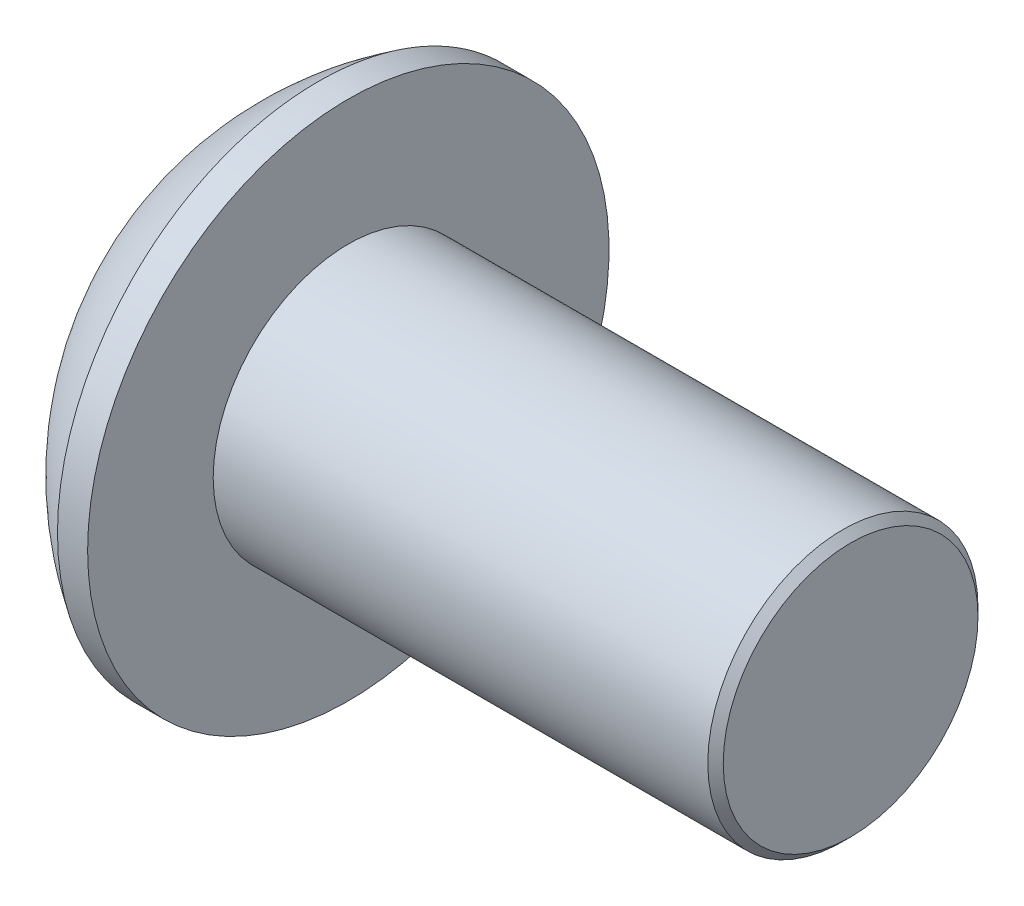
ISO-10303-21;
HEADER;
FILE_DESCRIPTION(('STEP AP214'),'2;1');
FILE_NAME('part.step','',(''),(''),'','','');
FILE_SCHEMA(('AUTOMOTIVE_DESIGN { 1 0 10303 214 1 1 1 1 }'));
ENDSEC;
DATA;
#1=APPLICATION_CONTEXT('core data for automotive mechanical design processes');
#2=APPLICATION_PROTOCOL_DEFINITION('international standard','automotive_design',2000,#1);
#3=PRODUCT_CONTEXT('',#1,'mechanical');
#4=PRODUCT('Part','Part','',(#3));
#5=PRODUCT_RELATED_PRODUCT_CATEGORY('part','',(#4));
#6=PRODUCT_DEFINITION_FORMATION('','',#4);
#7=PRODUCT_DEFINITION_CONTEXT('part definition',#1,'design');
#8=PRODUCT_DEFINITION('design','',#6,#7);
#9=PRODUCT_DEFINITION_SHAPE('','',#8);
#10=(LENGTH_UNIT() NAMED_UNIT(*) SI_UNIT(.MILLI.,.METRE.));
#11=(NAMED_UNIT(*) PLANE_ANGLE_UNIT() SI_UNIT($,.RADIAN.));
#12=(NAMED_UNIT(*) SI_UNIT($,.STERADIAN.) SOLID_ANGLE_UNIT());
#13=UNCERTAINTY_MEASURE_WITH_UNIT(LENGTH_MEASURE(1.E-05),#10,'distance_accuracy_value','');
#14=(GEOMETRIC_REPRESENTATION_CONTEXT(3) GLOBAL_UNCERTAINTY_ASSIGNED_CONTEXT((#13)) GLOBAL_UNIT_ASSIGNED_CONTEXT((#10,
#11,#12)) REPRESENTATION_CONTEXT('',''));
#15=CARTESIAN_POINT('',(0.,0.,0.));
#16=DIRECTION('',(0.,0.,1.));
#17=DIRECTION('',(1.,0.,0.));
#18=AXIS2_PLACEMENT_3D('',#15,#16,#17);
#19=CARTESIAN_POINT('',(1.32080000000034,0.,0.));
#20=DIRECTION('',(-1.,0.,0.));
#21=DIRECTION('',(0.,0.,1.));
#22=AXIS2_PLACEMENT_3D('',#19,#20,#21);
#23=CONICAL_SURFACE('',#22,1.1937999999998,1.04719755119608);
#24=CARTESIAN_POINT('',(2.01004075135902,0.,4.44089209850063E-13));
#25=VERTEX_POINT('',#24);
#26=VERTEX_LOOP('',#25);
#27=FACE_BOUND('',#26,.T.);
#28=CARTESIAN_POINT('',(1.32080000000009,0.,0.));
#29=DIRECTION('',(-1.,0.,0.));
#30=DIRECTION('',(0.,0.,1.));
#31=AXIS2_PLACEMENT_3D('',#28,#29,#30);
#32=CIRCLE('',#31,1.19380000000024);
#33=CARTESIAN_POINT('',(1.32080000000004,-1.03386112703797,0.59690000000006));
#34=VERTEX_POINT('',#33);
#35=CARTESIAN_POINT('',(1.32080000000004,0.,1.19380000000012));
#36=VERTEX_POINT('',#35);
#37=EDGE_CURVE('E19',#34,#36,#32,.T.);
#38=ORIENTED_EDGE('',*,*,#37,.T.);
#39=CARTESIAN_POINT('',(1.32080000000009,0.,0.));
#40=DIRECTION('',(-1.,0.,0.));
#41=DIRECTION('',(0.,0.,1.));
#42=AXIS2_PLACEMENT_3D('',#39,#40,#41);
#43=CIRCLE('',#42,1.19380000000024);
#44=CARTESIAN_POINT('',(1.32080000000004,1.03386112703797,0.596900000000061));
#45=VERTEX_POINT('',#44);
#46=EDGE_CURVE('E148',#36,#45,#43,.T.);
#47=ORIENTED_EDGE('',*,*,#46,.T.);
#48=CARTESIAN_POINT('',(1.32080000000009,0.,0.));
#49=DIRECTION('',(-1.,0.,0.));
#50=DIRECTION('',(0.,0.,1.));
#51=AXIS2_PLACEMENT_3D('',#48,#49,#50);
#52=CIRCLE('',#51,1.19380000000024);
#53=CARTESIAN_POINT('',(1.32080000000004,1.03386112703797,-0.596900000000061));
#54=VERTEX_POINT('',#53);
#55=EDGE_CURVE('E476',#45,#54,#52,.T.);
#56=ORIENTED_EDGE('',*,*,#55,.T.);
#57=CARTESIAN_POINT('',(1.32080000000009,0.,0.));
#58=DIRECTION('',(-1.,0.,0.));
#59=DIRECTION('',(0.,0.,1.));
#60=AXIS2_PLACEMENT_3D('',#57,#58,#59);
#61=CIRCLE('',#60,1.19380000000024);
#62=CARTESIAN_POINT('',(1.32080000000004,1.49457637585666E-12,-1.19380000000012));
#63=VERTEX_POINT('',#62);
#64=EDGE_CURVE('E477',#54,#63,#61,.T.);
#65=ORIENTED_EDGE('',*,*,#64,.T.);
#66=CARTESIAN_POINT('',(1.32080000000009,0.,0.));
#67=DIRECTION('',(-1.,0.,0.));
#68=DIRECTION('',(0.,0.,1.));
#69=AXIS2_PLACEMENT_3D('',#66,#67,#68);
#70=CIRCLE('',#69,1.19380000000024);
#71=CARTESIAN_POINT('',(1.32080000000004,-1.03386112703797,-0.59690000000006));
#72=VERTEX_POINT('',#71);
#73=EDGE_CURVE('E92',#63,#72,#70,.T.);
#74=ORIENTED_EDGE('',*,*,#73,.T.);
#75=CARTESIAN_POINT('',(1.32080000000009,0.,0.));
#76=DIRECTION('',(-1.,0.,0.));
#77=DIRECTION('',(0.,0.,1.));
#78=AXIS2_PLACEMENT_3D('',#75,#76,#77);
#79=CIRCLE('',#78,1.19380000000024);
#80=EDGE_CURVE('E88',#72,#34,#79,.T.);
#81=ORIENTED_EDGE('',*,*,#80,.T.);
#82=EDGE_LOOP('',(#38,#47,#56,#65,#74,#81));
#83=FACE_BOUND('',#82,.T.);
#84=ADVANCED_FACE('F16',(#27,#83),#23,.F.);
#85=CARTESIAN_POINT('',(1.3208,-2.06772225407572,-1.1938));
#86=DIRECTION('',(1.,0.,0.));
#87=DIRECTION('',(0.,0.,-1.));
#88=AXIS2_PLACEMENT_3D('',#85,#86,#87);
#89=PLANE('',#88);
#90=DIRECTION('',(0.,0.5,0.866025403784439));
#91=VECTOR('',#90,1.);
#92=CARTESIAN_POINT('',(1.3208,-1.37848150271715,0.));
#93=LINE('',#92,#91);
#94=CARTESIAN_POINT('',(1.3208,-0.689240751358574,1.1938));
#95=VERTEX_POINT('',#94);
#96=EDGE_CURVE('E100',#95,#34,#93,.F.);
#97=ORIENTED_EDGE('',*,*,#96,.F.);
#98=DIRECTION('',(0.,1.,0.));
#99=VECTOR('',#98,1.);
#100=CARTESIAN_POINT('',(1.3208,-0.689240751358574,1.1938));
#101=LINE('',#100,#99);
#102=EDGE_CURVE('E102',#36,#95,#101,.F.);
#103=ORIENTED_EDGE('',*,*,#102,.F.);
#104=ORIENTED_EDGE('',*,*,#37,.F.);
#105=EDGE_LOOP('',(#97,#103,#104));
#106=FACE_BOUND('',#105,.T.);
#107=ADVANCED_FACE('F98',(#106),#89,.F.);
#108=CARTESIAN_POINT('',(1.3208,-2.06772225407572,-1.1938));
#109=DIRECTION('',(1.,0.,0.));
#110=DIRECTION('',(0.,0.,-1.));
#111=AXIS2_PLACEMENT_3D('',#108,#109,#110);
#112=PLANE('',#111);
#113=DIRECTION('',(0.,-0.5,0.866025403784439));
#114=VECTOR('',#113,1.);
#115=CARTESIAN_POINT('',(1.3208,-0.689240751358574,-1.1938));
#116=LINE('',#115,#114);
#117=CARTESIAN_POINT('',(1.3208,-1.37848150271715,0.));
#118=VERTEX_POINT('',#117);
#119=EDGE_CURVE('E108',#118,#72,#116,.F.);
#120=ORIENTED_EDGE('',*,*,#119,.F.);
#121=DIRECTION('',(0.,0.5,0.866025403784439));
#122=VECTOR('',#121,1.);
#123=CARTESIAN_POINT('',(1.3208,-1.37848150271715,0.));
#124=LINE('',#123,#122);
#125=EDGE_CURVE('E105',#34,#118,#124,.F.);
#126=ORIENTED_EDGE('',*,*,#125,.F.);
#127=ORIENTED_EDGE('',*,*,#80,.F.);
#128=EDGE_LOOP('',(#120,#126,#127));
#129=FACE_BOUND('',#128,.T.);
#130=ADVANCED_FACE('F106',(#129),#112,.F.);
#131=CARTESIAN_POINT('',(1.3208,-2.06772225407572,-1.1938));
#132=DIRECTION('',(1.,0.,0.));
#133=DIRECTION('',(0.,0.,-1.));
#134=AXIS2_PLACEMENT_3D('',#131,#132,#133);
#135=PLANE('',#134);
#136=DIRECTION('',(0.,1.,0.));
#137=VECTOR('',#136,1.);
#138=CARTESIAN_POINT('',(1.3208,0.689240751358577,-1.1938));
#139=LINE('',#138,#137);
#140=CARTESIAN_POINT('',(1.3208,-0.689240751358574,-1.1938));
#141=VERTEX_POINT('',#140);
#142=EDGE_CURVE('E447',#141,#63,#139,.T.);
#143=ORIENTED_EDGE('',*,*,#142,.F.);
#144=DIRECTION('',(0.,-0.5,0.866025403784439));
#145=VECTOR('',#144,1.);
#146=CARTESIAN_POINT('',(1.3208,-0.689240751358574,-1.1938));
#147=LINE('',#146,#145);
#148=EDGE_CURVE('E459',#72,#141,#147,.F.);
#149=ORIENTED_EDGE('',*,*,#148,.F.);
#150=ORIENTED_EDGE('',*,*,#73,.F.);
#151=EDGE_LOOP('',(#143,#149,#150));
#152=FACE_BOUND('',#151,.T.);
#153=ADVANCED_FACE('F191',(#152),#135,.F.);
#154=CARTESIAN_POINT('',(1.3208,-2.06772225407572,-1.1938));
#155=DIRECTION('',(1.,0.,0.));
#156=DIRECTION('',(0.,0.,-1.));
#157=AXIS2_PLACEMENT_3D('',#154,#155,#156);
#158=PLANE('',#157);
#159=DIRECTION('',(0.,-0.5,-0.866025403784439));
#160=VECTOR('',#159,1.);
#161=CARTESIAN_POINT('',(1.3208,1.37848150271715,0.));
#162=LINE('',#161,#160);
#163=CARTESIAN_POINT('',(1.3208,0.689240751358577,-1.1938));
#164=VERTEX_POINT('',#163);
#165=EDGE_CURVE('E433',#164,#54,#162,.F.);
#166=ORIENTED_EDGE('',*,*,#165,.F.);
#167=DIRECTION('',(0.,1.,0.));
#168=VECTOR('',#167,1.);
#169=CARTESIAN_POINT('',(1.3208,0.689240751358577,-1.1938));
#170=LINE('',#169,#168);
#171=EDGE_CURVE('E444',#63,#164,#170,.T.);
#172=ORIENTED_EDGE('',*,*,#171,.F.);
#173=ORIENTED_EDGE('',*,*,#64,.F.);
#174=EDGE_LOOP('',(#166,#172,#173));
#175=FACE_BOUND('',#174,.T.);
#176=ADVANCED_FACE('F187',(#175),#158,.F.);
#177=CARTESIAN_POINT('',(1.3208,-2.06772225407572,-1.1938));
#178=DIRECTION('',(1.,0.,0.));
#179=DIRECTION('',(0.,0.,-1.));
#180=AXIS2_PLACEMENT_3D('',#177,#178,#179);
#181=PLANE('',#180);
#182=DIRECTION('',(0.,0.5,-0.866025403784439));
#183=VECTOR('',#182,1.);
#184=CARTESIAN_POINT('',(1.3208,0.689240751358576,1.1938));
#185=LINE('',#184,#183);
#186=CARTESIAN_POINT('',(1.3208,1.37848150271715,0.));
#187=VERTEX_POINT('',#186);
#188=EDGE_CURVE('E412',#187,#45,#185,.F.);
#189=ORIENTED_EDGE('',*,*,#188,.F.);
#190=DIRECTION('',(0.,-0.5,-0.866025403784439));
#191=VECTOR('',#190,1.);
#192=CARTESIAN_POINT('',(1.3208,1.37848150271715,0.));
#193=LINE('',#192,#191);
#194=EDGE_CURVE('E431',#54,#187,#193,.F.);
#195=ORIENTED_EDGE('',*,*,#194,.F.);
#196=ORIENTED_EDGE('',*,*,#55,.F.);
#197=EDGE_LOOP('',(#189,#195,#196));
#198=FACE_BOUND('',#197,.T.);
#199=ADVANCED_FACE('F183',(#198),#181,.F.);
#200=CARTESIAN_POINT('',(1.3208,-2.06772225407572,-1.1938));
#201=DIRECTION('',(1.,0.,0.));
#202=DIRECTION('',(0.,0.,-1.));
#203=AXIS2_PLACEMENT_3D('',#200,#201,#202);
#204=PLANE('',#203);
#205=DIRECTION('',(0.,1.,0.));
#206=VECTOR('',#205,1.);
#207=CARTESIAN_POINT('',(1.3208,-0.689240751358574,1.1938));
#208=LINE('',#207,#206);
#209=CARTESIAN_POINT('',(1.3208,0.689240751358576,1.1938));
#210=VERTEX_POINT('',#209);
#211=EDGE_CURVE('E117',#210,#36,#208,.F.);
#212=ORIENTED_EDGE('',*,*,#211,.F.);
#213=DIRECTION('',(0.,0.5,-0.866025403784439));
#214=VECTOR('',#213,1.);
#215=CARTESIAN_POINT('',(1.3208,0.689240751358576,1.1938));
#216=LINE('',#215,#214);
#217=EDGE_CURVE('E415',#45,#210,#216,.F.);
#218=ORIENTED_EDGE('',*,*,#217,.F.);
#219=ORIENTED_EDGE('',*,*,#46,.F.);
#220=EDGE_LOOP('',(#212,#218,#219));
#221=FACE_BOUND('',#220,.T.);
#222=ADVANCED_FACE('F179',(#221),#204,.F.);
#223=CARTESIAN_POINT('',(1.3208,-0.689240751358574,1.1938));
#224=DIRECTION('',(0.,0.,-1.));
#225=DIRECTION('',(0.,1.,0.));
#226=AXIS2_PLACEMENT_3D('',#223,#224,#225);
#227=PLANE('',#226);
#228=DIRECTION('',(0.,1.,0.));
#229=VECTOR('',#228,1.);
#230=CARTESIAN_POINT('',(0.,0.,1.1938));
#231=LINE('',#230,#229);
#232=CARTESIAN_POINT('',(0.,0.689240751358577,1.1938));
#233=VERTEX_POINT('',#232);
#234=CARTESIAN_POINT('',(0.,-0.689240751358574,1.1938));
#235=VERTEX_POINT('',#234);
#236=EDGE_CURVE('E409',#233,#235,#231,.F.);
#237=ORIENTED_EDGE('',*,*,#236,.F.);
#238=DIRECTION('',(1.,0.,0.));
#239=VECTOR('',#238,1.);
#240=CARTESIAN_POINT('',(1.3208,0.689240751358576,1.1938));
#241=LINE('',#240,#239);
#242=EDGE_CURVE('E421',#210,#233,#241,.F.);
#243=ORIENTED_EDGE('',*,*,#242,.F.);
#244=ORIENTED_EDGE('',*,*,#211,.T.);
#245=ORIENTED_EDGE('',*,*,#102,.T.);
#246=DIRECTION('',(1.,0.,0.));
#247=VECTOR('',#246,1.);
#248=CARTESIAN_POINT('',(1.3208,-0.689240751358574,1.1938));
#249=LINE('',#248,#247);
#250=EDGE_CURVE('E111',#235,#95,#249,.T.);
#251=ORIENTED_EDGE('',*,*,#250,.F.);
#252=EDGE_LOOP('',(#237,#243,#244,#245,#251));
#253=FACE_BOUND('',#252,.T.);
#254=ADVANCED_FACE('F176',(#253),#227,.T.);
#255=CARTESIAN_POINT('',(1.3208,-1.37848150271715,0.));
#256=DIRECTION('',(0.,0.866025403784439,-0.5));
#257=DIRECTION('',(0.,0.5,0.866025403784439));
#258=AXIS2_PLACEMENT_3D('',#255,#256,#257);
#259=PLANE('',#258);
#260=DIRECTION('',(0.,-0.5,-0.866025403784439));
#261=VECTOR('',#260,1.);
#262=CARTESIAN_POINT('',(0.,-0.689240751358574,1.1938));
#263=LINE('',#262,#261);
#264=CARTESIAN_POINT('',(0.,-1.37848150271715,0.));
#265=VERTEX_POINT('',#264);
#266=EDGE_CURVE('E406',#235,#265,#263,.T.);
#267=ORIENTED_EDGE('',*,*,#266,.F.);
#268=ORIENTED_EDGE('',*,*,#250,.T.);
#269=ORIENTED_EDGE('',*,*,#96,.T.);
#270=ORIENTED_EDGE('',*,*,#125,.T.);
#271=DIRECTION('',(1.,0.,0.));
#272=VECTOR('',#271,1.);
#273=CARTESIAN_POINT('',(1.3208,-1.37848150271715,0.));
#274=LINE('',#273,#272);
#275=EDGE_CURVE('E456',#265,#118,#274,.T.);
#276=ORIENTED_EDGE('',*,*,#275,.F.);
#277=EDGE_LOOP('',(#267,#268,#269,#270,#276));
#278=FACE_BOUND('',#277,.T.);
#279=ADVANCED_FACE('F115',(#278),#259,.T.);
#280=CARTESIAN_POINT('',(1.3208,-0.689240751358574,-1.1938));
#281=DIRECTION('',(0.,0.866025403784439,0.5));
#282=DIRECTION('',(0.,-0.5,0.866025403784439));
#283=AXIS2_PLACEMENT_3D('',#280,#281,#282);
#284=PLANE('',#283);
#285=DIRECTION('',(0.,0.5,-0.866025403784439));
#286=VECTOR('',#285,1.);
#287=CARTESIAN_POINT('',(0.,-1.37848150271715,0.));
#288=LINE('',#287,#286);
#289=CARTESIAN_POINT('',(0.,-0.689240751358574,-1.1938));
#290=VERTEX_POINT('',#289);
#291=EDGE_CURVE('E403',#265,#290,#288,.T.);
#292=ORIENTED_EDGE('',*,*,#291,.F.);
#293=ORIENTED_EDGE('',*,*,#275,.T.);
#294=ORIENTED_EDGE('',*,*,#119,.T.);
#295=ORIENTED_EDGE('',*,*,#148,.T.);
#296=DIRECTION('',(1.,0.,0.));
#297=VECTOR('',#296,1.);
#298=CARTESIAN_POINT('',(1.3208,-0.689240751358574,-1.1938));
#299=LINE('',#298,#297);
#300=EDGE_CURVE('E441',#290,#141,#299,.T.);
#301=ORIENTED_EDGE('',*,*,#300,.F.);
#302=EDGE_LOOP('',(#292,#293,#294,#295,#301));
#303=FACE_BOUND('',#302,.T.);
#304=ADVANCED_FACE('F169',(#303),#284,.T.);
#305=CARTESIAN_POINT('',(1.3208,0.689240751358577,-1.1938));
#306=DIRECTION('',(0.,0.,1.));
#307=DIRECTION('',(1.,0.,0.));
#308=AXIS2_PLACEMENT_3D('',#305,#306,#307);
#309=PLANE('',#308);
#310=DIRECTION('',(0.,1.,0.));
#311=VECTOR('',#310,1.);
#312=CARTESIAN_POINT('',(0.,0.,-1.1938));
#313=LINE('',#312,#311);
#314=CARTESIAN_POINT('',(0.,0.689240751358577,-1.1938));
#315=VERTEX_POINT('',#314);
#316=EDGE_CURVE('E400',#290,#315,#313,.T.);
#317=ORIENTED_EDGE('',*,*,#316,.F.);
#318=ORIENTED_EDGE('',*,*,#300,.T.);
#319=ORIENTED_EDGE('',*,*,#142,.T.);
#320=ORIENTED_EDGE('',*,*,#171,.T.);
#321=DIRECTION('',(1.,0.,0.));
#322=VECTOR('',#321,1.);
#323=CARTESIAN_POINT('',(1.3208,0.689240751358577,-1.1938));
#324=LINE('',#323,#322);
#325=EDGE_CURVE('E416',#315,#164,#324,.T.);
#326=ORIENTED_EDGE('',*,*,#325,.F.);
#327=EDGE_LOOP('',(#317,#318,#319,#320,#326));
#328=FACE_BOUND('',#327,.T.);
#329=ADVANCED_FACE('F166',(#328),#309,.T.);
#330=CARTESIAN_POINT('',(1.3208,1.37848150271715,0.));
#331=DIRECTION('',(0.,-0.866025403784439,0.5));
#332=DIRECTION('',(0.,-0.5,-0.866025403784439));
#333=AXIS2_PLACEMENT_3D('',#330,#331,#332);
#334=PLANE('',#333);
#335=DIRECTION('',(0.,0.5,0.866025403784439));
#336=VECTOR('',#335,1.);
#337=CARTESIAN_POINT('',(0.,0.689240751358577,-1.1938));
#338=LINE('',#337,#336);
#339=CARTESIAN_POINT('',(0.,1.37848150271715,0.));
#340=VERTEX_POINT('',#339);
#341=EDGE_CURVE('E397',#315,#340,#338,.T.);
#342=ORIENTED_EDGE('',*,*,#341,.F.);
#343=ORIENTED_EDGE('',*,*,#325,.T.);
#344=ORIENTED_EDGE('',*,*,#165,.T.);
#345=ORIENTED_EDGE('',*,*,#194,.T.);
#346=DIRECTION('',(1.,0.,0.));
#347=VECTOR('',#346,1.);
#348=CARTESIAN_POINT('',(1.3208,1.37848150271715,0.));
#349=LINE('',#348,#347);
#350=EDGE_CURVE('E34',#340,#187,#349,.T.);
#351=ORIENTED_EDGE('',*,*,#350,.F.);
#352=EDGE_LOOP('',(#342,#343,#344,#345,#351));
#353=FACE_BOUND('',#352,.T.);
#354=ADVANCED_FACE('F162',(#353),#334,.T.);
#355=CARTESIAN_POINT('',(1.3208,0.689240751358576,1.1938));
#356=DIRECTION('',(0.,-0.866025403784439,-0.5));
#357=DIRECTION('',(0.,0.5,-0.866025403784439));
#358=AXIS2_PLACEMENT_3D('',#355,#356,#357);
#359=PLANE('',#358);
#360=DIRECTION('',(0.,-0.5,0.866025403784439));
#361=VECTOR('',#360,1.);
#362=CARTESIAN_POINT('',(0.,1.37848150271715,0.));
#363=LINE('',#362,#361);
#364=EDGE_CURVE('E147',#340,#233,#363,.T.);
#365=ORIENTED_EDGE('',*,*,#364,.F.);
#366=ORIENTED_EDGE('',*,*,#350,.T.);
#367=ORIENTED_EDGE('',*,*,#188,.T.);
#368=ORIENTED_EDGE('',*,*,#217,.T.);
#369=ORIENTED_EDGE('',*,*,#242,.T.);
#370=EDGE_LOOP('',(#365,#366,#367,#368,#369));
#371=FACE_BOUND('',#370,.T.);
#372=ADVANCED_FACE('F158',(#371),#359,.T.);
#373=CARTESIAN_POINT('',(0.,0.,0.));
#374=DIRECTION('',(-1.,0.,0.));
#375=DIRECTION('',(0.,0.,1.));
#376=AXIS2_PLACEMENT_3D('',#373,#374,#375);
#377=PLANE('',#376);
#378=ORIENTED_EDGE('',*,*,#341,.T.);
#379=ORIENTED_EDGE('',*,*,#364,.T.);
#380=ORIENTED_EDGE('',*,*,#236,.T.);
#381=ORIENTED_EDGE('',*,*,#266,.T.);
#382=ORIENTED_EDGE('',*,*,#291,.T.);
#383=ORIENTED_EDGE('',*,*,#316,.T.);
#384=EDGE_LOOP('',(#378,#379,#380,#381,#382,#383));
#385=FACE_BOUND('',#384,.T.);
#386=CARTESIAN_POINT('',(0.,1.647825,0.));
#387=CARTESIAN_POINT('',(1.63319194702151E-13,1.64781976319874,0.092490203977753));
#388=CARTESIAN_POINT('',(1.32890083579297E-13,1.63999511633709,0.18514501432637));
#389=CARTESIAN_POINT('',(0.,1.6167119250047,0.322075808080013));
#390=CARTESIAN_POINT('',(-1.58500729597375E-13,1.60700618770234,0.36743553339636));
#391=CARTESIAN_POINT('',(1.59063479291743E-13,1.58380101865853,0.45722093569514));
#392=CARTESIAN_POINT('',(5.6924253476393E-13,1.5702985083103,0.501645823115263));
#393=CARTESIAN_POINT('',(9.37393023603841E-13,1.52428156574313,0.632817459278967));
#394=CARTESIAN_POINT('',(0.,1.48621992666366,0.717681965518643));
#395=CARTESIAN_POINT('',(0.,1.39637079695658,0.879809706624016));
#396=CARTESIAN_POINT('',(7.82184274151218E-13,1.34458278455109,0.957072652379995));
#397=CARTESIAN_POINT('',(4.86982737501784E-13,1.25777784714521,1.06558770210237));
#398=CARTESIAN_POINT('',(1.33453761487452E-13,1.22729946114794,1.10054993332365));
#399=CARTESIAN_POINT('',(-1.3289162015903E-13,1.16354004969106,1.16775237388221));
#400=CARTESIAN_POINT('',(0.,1.13026175473033,1.19999517515816));
#401=CARTESIAN_POINT('',(0.,1.02649304340867,1.29236218866442));
#402=CARTESIAN_POINT('',(0.,0.952049986714077,1.34814848277712));
#403=CARTESIAN_POINT('',(0.,0.794895196754067,1.44639825105765));
#404=CARTESIAN_POINT('',(0.,0.712183775431296,1.48886222758992));
#405=CARTESIAN_POINT('',(0.,0.540796624265731,1.55930919813143));
#406=CARTESIAN_POINT('',(0.,0.452120958135287,1.58729234680268));
#407=CARTESIAN_POINT('',(0.,0.271332331080319,1.62797191307413));
#408=CARTESIAN_POINT('',(0.,0.179219351801791,1.64066824903626));
#409=CARTESIAN_POINT('',(0.,-0.0058307702784061,1.65041748705408));
#410=CARTESIAN_POINT('',(0.,-0.0987679130800752,1.64747038910978));
#411=CARTESIAN_POINT('',(0.,-0.282830196388822,1.62601274134435));
#412=CARTESIAN_POINT('',(0.,-0.373955346570016,1.60750227463794));
#413=CARTESIAN_POINT('',(0.,-0.551796068178801,1.55545413364523));
#414=CARTESIAN_POINT('',(0.,-0.638511592498163,1.52191629885843));
#415=CARTESIAN_POINT('',(0.,-0.805120175533149,1.44072378052346));
#416=CARTESIAN_POINT('',(0.,-0.885012976819951,1.39306856461393));
#417=CARTESIAN_POINT('',(0.,-0.997912879588355,1.31211658756413));
#418=CARTESIAN_POINT('',(0.,-1.0343949246834,1.28354906167734));
#419=CARTESIAN_POINT('',(0.,-1.10486279842068,1.22341829303709));
#420=CARTESIAN_POINT('',(0.,-1.13884618403291,1.19185218578117));
#421=CARTESIAN_POINT('',(0.,-1.23657300939908,1.09305906467359));
#422=CARTESIAN_POINT('',(0.,-1.29619288399356,1.02166556658612));
#423=CARTESIAN_POINT('',(0.,-1.40258050817755,0.869876423478031));
#424=CARTESIAN_POINT('',(0.,-1.44934874627766,0.789481120793477));
#425=CARTESIAN_POINT('',(0.,-1.50889406070375,0.66387095931334));
#426=CARTESIAN_POINT('',(0.,-1.52698985473586,0.621110806760426));
#427=CARTESIAN_POINT('',(0.,-1.55950093966664,0.53426077686433));
#428=CARTESIAN_POINT('',(-1.05235362596779E-13,-1.57391920916438,0.490172008203167));
#429=CARTESIAN_POINT('',(2.10568324685354E-13,-1.61146177909579,0.356445777718595));
#430=CARTESIAN_POINT('',(1.14396658334039E-12,-1.62897899568074,0.265126085962904));
#431=CARTESIAN_POINT('',(4.347347107204E-13,-1.64174347214908,0.144386595969386));
#432=CARTESIAN_POINT('',(1.21682740895759E-13,-1.64402207668915,0.115560405797873));
#433=CARTESIAN_POINT('',(-1.21249060026839E-13,-1.6470636594012,0.0578281757252688));
#434=CARTESIAN_POINT('',(0.,-1.64782663757318,0.0289221358241775));
#435=CARTESIAN_POINT('',(1.63505268006993E-13,-1.64781976319874,-0.0924902039777536));
#436=CARTESIAN_POINT('',(1.32794566155401E-13,-1.63999511633709,-0.18514501432637));
#437=CARTESIAN_POINT('',(0.,-1.6167119250047,-0.322075808080014));
#438=CARTESIAN_POINT('',(-1.58310187784522E-13,-1.60700618770234,-0.367435533396361));
#439=CARTESIAN_POINT('',(1.58872782530651E-13,-1.58380101865853,-0.45722093569514));
#440=CARTESIAN_POINT('',(5.68527399730162E-13,-1.5702985083103,-0.501645823115263));
#441=CARTESIAN_POINT('',(9.36221934104128E-13,-1.52428156574313,-0.632817459278966));
#442=CARTESIAN_POINT('',(0.,-1.48621992666366,-0.717681965518643));
#443=CARTESIAN_POINT('',(0.,-1.39637079695658,-0.879809706624015));
#444=CARTESIAN_POINT('',(7.809853327574E-13,-1.34458278455109,-0.957072652379992));
#445=CARTESIAN_POINT('',(4.86281382838322E-13,-1.25777784714521,-1.06558770210237));
#446=CARTESIAN_POINT('',(1.33300307899813E-13,-1.22729946114794,-1.10054993332365));
#447=CARTESIAN_POINT('',(-1.32738314523763E-13,-1.16354004969107,-1.16775237388221));
#448=CARTESIAN_POINT('',(0.,-1.13026175473033,-1.19999517515816));
#449=CARTESIAN_POINT('',(0.,-1.02649304340867,-1.29236218866442));
#450=CARTESIAN_POINT('',(0.,-0.952049986714081,-1.34814848277713));
#451=CARTESIAN_POINT('',(0.,-0.794895196754072,-1.44639825105765));
#452=CARTESIAN_POINT('',(0.,-0.7121837754313,-1.48886222758991));
#453=CARTESIAN_POINT('',(0.,-0.540796624265734,-1.55930919813143));
#454=CARTESIAN_POINT('',(0.,-0.452120958135291,-1.58729234680268));
#455=CARTESIAN_POINT('',(0.,-0.271332331080322,-1.62797191307413));
#456=CARTESIAN_POINT('',(0.,-0.179219351801793,-1.64066824903626));
#457=CARTESIAN_POINT('',(0.,0.00583077027840386,-1.65041748705408));
#458=CARTESIAN_POINT('',(0.,0.0987679130800731,-1.64747038910978));
#459=CARTESIAN_POINT('',(0.,0.28283019638882,-1.62601274134436));
#460=CARTESIAN_POINT('',(0.,0.373955346570014,-1.60750227463794));
#461=CARTESIAN_POINT('',(0.,0.551796068178799,-1.55545413364523));
#462=CARTESIAN_POINT('',(0.,0.638511592498161,-1.52191629885844));
#463=CARTESIAN_POINT('',(0.,0.805120175533147,-1.44072378052347));
#464=CARTESIAN_POINT('',(0.,0.885012976819949,-1.39306856461393));
#465=CARTESIAN_POINT('',(0.,0.997912879588353,-1.31211658756413));
#466=CARTESIAN_POINT('',(0.,1.03439492468339,-1.28354906167734));
#467=CARTESIAN_POINT('',(0.,1.10486279842068,-1.22341829303709));
#468=CARTESIAN_POINT('',(0.,1.1388461840329,-1.19185218578117));
#469=CARTESIAN_POINT('',(0.,1.23657300939908,-1.09305906467358));
#470=CARTESIAN_POINT('',(0.,1.29619288399356,-1.02166556658612));
#471=CARTESIAN_POINT('',(0.,1.40258050817755,-0.869876423478032));
#472=CARTESIAN_POINT('',(0.,1.44934874627765,-0.789481120793476));
#473=CARTESIAN_POINT('',(0.,1.50889406070375,-0.66387095931334));
#474=CARTESIAN_POINT('',(0.,1.52698985473586,-0.621110806760427));
#475=CARTESIAN_POINT('',(0.,1.55950093966664,-0.534260776864331));
#476=CARTESIAN_POINT('',(-1.05163336027755E-13,1.57391920916437,-0.490172008203168));
#477=CARTESIAN_POINT('',(2.10424649207135E-13,1.61146177909579,-0.356445777718595));
#478=CARTESIAN_POINT('',(1.1439193518672E-12,1.62897899568074,-0.265126085962905));
#479=CARTESIAN_POINT('',(4.34749480231378E-13,1.64174347214908,-0.144386595969387));
#480=CARTESIAN_POINT('',(1.21707467703441E-13,1.64402207668915,-0.115560405797874));
#481=CARTESIAN_POINT('',(-1.21273786834522E-13,1.6470636594012,-0.0578281757252697));
#482=CARTESIAN_POINT('',(0.,1.64782663757318,-0.0289221358241784));
#483=CARTESIAN_POINT('',(0.,1.647825,0.));
#484=B_SPLINE_CURVE_WITH_KNOTS('',3,(#386,#387,#388,#389,#390,#391,#392,#393,#394,#395,#396,
#397,#398,#399,#400,#401,#402,#403,#404,#405,#406,#407,#408,#409,#410,#411,#412,#413,#414,#415,
#416,#417,#418,#419,#420,#421,#422,#423,#424,#425,#426,#427,#428,#429,#430,#431,#432,#433,#434,
#435,#436,#437,#438,#439,#440,#441,#442,#443,#444,#445,#446,#447,#448,#449,#450,#451,#452,#453,
#454,#455,#456,#457,#458,#459,#460,#461,#462,#463,#464,#465,#466,#467,#468,#469,#470,#471,#472,
#473,#474,#475,#476,#477,#478,#479,#480,#481,#482,#483),.UNSPECIFIED.,.T.,.F.,(4,2,2,2,2,2,2,2,
2,2,2,2,2,2,2,2,2,2,2,2,2,2,2,2,2,2,2,2,2,2,2,2,2,2,2,2,2,2,2,2,2,2,2,2,2,2,2,2,4),(0.,
0.277336029422426,0.416368541537111,0.5555141146256,0.833141970294986,1.11078038089036,
1.24978149120748,1.38864858351854,1.66629367015056,1.94392828594775,2.22155993641642,
2.49919306954937,2.77682620268234,3.05445785315101,3.3320924689482,3.6097375555799,
3.74860464789074,3.88760575820767,4.16524416880332,4.44287202447287,4.5820175975616,
4.72105010967662,4.99838613909882,5.08511046196677,5.17183478483476,5.44917081425719,
5.58820332637187,5.72734889946036,6.00497675512975,6.28261516572512,6.42161627604224,
6.5604833683533,6.83812845498532,7.11576307078251,7.39339472125118,7.67102785438413,
7.9486609875171,8.22629263798578,8.50392725378296,8.78157234041466,8.9204394327255,
9.05944054304243,9.33707895363808,9.61470680930763,9.75385238239637,9.89288489451138,
10.1702209239336,10.2569452468015,10.3436695696695),.UNSPECIFIED.);
#485=CARTESIAN_POINT('',(0.,1.647825,0.));
#486=VERTEX_POINT('',#485);
#487=EDGE_CURVE('E139',#486,#486,#484,.T.);
#488=ORIENTED_EDGE('',*,*,#487,.F.);
#489=EDGE_LOOP('',(#488));
#490=FACE_BOUND('',#489,.T.);
#491=ADVANCED_FACE('F154',(#385,#490),#377,.T.);
#492=CARTESIAN_POINT('',(3.50132362607759,0.,0.));
#493=DIRECTION('',(0.,1.,0.));
#494=DIRECTION('',(1.,0.,0.));
#495=AXIS2_PLACEMENT_3D('',#492,#493,#494);
#496=SPHERICAL_SURFACE('',#495,3.86970210289553);
#497=CARTESIAN_POINT('',(1.4732,0.,0.));
#498=DIRECTION('',(-1.,0.,0.));
#499=DIRECTION('',(0.,0.,1.));
#500=AXIS2_PLACEMENT_3D('',#497,#498,#499);
#501=CIRCLE('',#500,3.29565);
#502=CARTESIAN_POINT('',(1.4732,0.,3.29565));
#503=VERTEX_POINT('',#502);
#504=EDGE_CURVE('E136',#503,#503,#501,.F.);
#505=ORIENTED_EDGE('',*,*,#504,.F.);
#506=EDGE_LOOP('',(#505));
#507=FACE_BOUND('',#506,.T.);
#508=ORIENTED_EDGE('',*,*,#487,.T.);
#509=EDGE_LOOP('',(#508));
#510=FACE_BOUND('',#509,.T.);
#511=ADVANCED_FACE('F150',(#507,#510),#496,.T.);
#512=CARTESIAN_POINT('',(8.2042,0.,0.));
#513=DIRECTION('',(-1.,0.,0.));
#514=DIRECTION('',(0.,0.,1.));
#515=AXIS2_PLACEMENT_3D('',#512,#513,#514);
#516=PLANE('',#515);
#517=CARTESIAN_POINT('',(8.20419999996602,0.,0.));
#518=DIRECTION('',(-1.,0.,0.));
#519=DIRECTION('',(0.,0.,1.));
#520=AXIS2_PLACEMENT_3D('',#517,#518,#519);
#521=CIRCLE('',#520,1.61036000002923);
#522=CARTESIAN_POINT('',(8.20419999996602,0.,1.61036000002923));
#523=VERTEX_POINT('',#522);
#524=EDGE_CURVE('E133',#523,#523,#521,.T.);
#525=ORIENTED_EDGE('',*,*,#524,.F.);
#526=EDGE_LOOP('',(#525));
#527=FACE_BOUND('',#526,.T.);
#528=ADVANCED_FACE('F221',(#527),#516,.F.);
#529=CARTESIAN_POINT('',(0.,0.,0.));
#530=DIRECTION('',(-1.,0.,0.));
#531=DIRECTION('',(0.,0.,1.));
#532=AXIS2_PLACEMENT_3D('',#529,#530,#531);
#533=CYLINDRICAL_SURFACE('',#532,3.29565);
#534=ORIENTED_EDGE('',*,*,#504,.T.);
#535=EDGE_LOOP('',(#534));
#536=FACE_BOUND('',#535,.T.);
#537=CARTESIAN_POINT('',(1.8542,0.,0.));
#538=DIRECTION('',(-1.,0.,0.));
#539=DIRECTION('',(0.,0.,1.));
#540=AXIS2_PLACEMENT_3D('',#537,#538,#539);
#541=CIRCLE('',#540,3.29565);
#542=CARTESIAN_POINT('',(1.8542,0.,3.29565));
#543=VERTEX_POINT('',#542);
#544=EDGE_CURVE('E130',#543,#543,#541,.T.);
#545=ORIENTED_EDGE('',*,*,#544,.T.);
#546=EDGE_LOOP('',(#545));
#547=FACE_BOUND('',#546,.T.);
#548=ADVANCED_FACE('F218',(#536,#547),#533,.T.);
#549=CARTESIAN_POINT('',(8.10640999998213,0.,0.));
#550=DIRECTION('',(-1.,0.,0.));
#551=DIRECTION('',(0.,0.,1.));
#552=AXIS2_PLACEMENT_3D('',#549,#550,#551);
#553=CONICAL_SURFACE('',#552,1.70814999995628,0.785398163106808);
#554=CARTESIAN_POINT('',(8.10641,0.,0.));
#555=DIRECTION('',(-1.,0.,0.));
#556=DIRECTION('',(0.,0.,1.));
#557=AXIS2_PLACEMENT_3D('',#554,#555,#556);
#558=CIRCLE('',#557,1.70815);
#559=CARTESIAN_POINT('',(8.10641,0.,1.70815));
#560=VERTEX_POINT('',#559);
#561=EDGE_CURVE('E25',#560,#560,#558,.T.);
#562=ORIENTED_EDGE('',*,*,#561,.F.);
#563=EDGE_LOOP('',(#562));
#564=FACE_BOUND('',#563,.T.);
#565=ORIENTED_EDGE('',*,*,#524,.T.);
#566=EDGE_LOOP('',(#565));
#567=FACE_BOUND('',#566,.T.);
#568=ADVANCED_FACE('F211',(#564,#567),#553,.T.);
#569=CARTESIAN_POINT('',(1.8542,1.70815,0.));
#570=DIRECTION('',(-1.,0.,0.));
#571=DIRECTION('',(0.,0.,1.));
#572=AXIS2_PLACEMENT_3D('',#569,#570,#571);
#573=PLANE('',#572);
#574=CARTESIAN_POINT('',(1.8542,0.,0.));
#575=DIRECTION('',(-1.,0.,0.));
#576=DIRECTION('',(0.,0.,1.));
#577=AXIS2_PLACEMENT_3D('',#574,#575,#576);
#578=CIRCLE('',#577,1.70815);
#579=CARTESIAN_POINT('',(1.8542,0.,1.70815));
#580=VERTEX_POINT('',#579);
#581=EDGE_CURVE('E11',#580,#580,#578,.F.);
#582=ORIENTED_EDGE('',*,*,#581,.F.);
#583=EDGE_LOOP('',(#582));
#584=FACE_BOUND('',#583,.T.);
#585=ORIENTED_EDGE('',*,*,#544,.F.);
#586=EDGE_LOOP('',(#585));
#587=FACE_BOUND('',#586,.T.);
#588=ADVANCED_FACE('F205',(#584,#587),#573,.F.);
#589=CARTESIAN_POINT('',(0.,0.,0.));
#590=DIRECTION('',(-1.,0.,0.));
#591=DIRECTION('',(0.,0.,1.));
#592=AXIS2_PLACEMENT_3D('',#589,#590,#591);
#593=CYLINDRICAL_SURFACE('',#592,1.70815);
#594=ORIENTED_EDGE('',*,*,#581,.T.);
#595=EDGE_LOOP('',(#594));
#596=FACE_BOUND('',#595,.T.);
#597=ORIENTED_EDGE('',*,*,#561,.T.);
#598=EDGE_LOOP('',(#597));
#599=FACE_BOUND('',#598,.T.);
#600=ADVANCED_FACE('F203',(#596,#599),#593,.T.);
#601=CLOSED_SHELL('',(#84,#107,#130,#153,#176,#199,#222,#254,#279,#304,#329,#354,#372,#491,#511,
#528,#548,#568,#588,#600));
#602=MANIFOLD_SOLID_BREP('B1',#601);
#603=ADVANCED_BREP_SHAPE_REPRESENTATION('',(#18,#602),#14);
#604=SHAPE_DEFINITION_REPRESENTATION(#9,#603);
ENDSEC;
END-ISO-10303-21;
